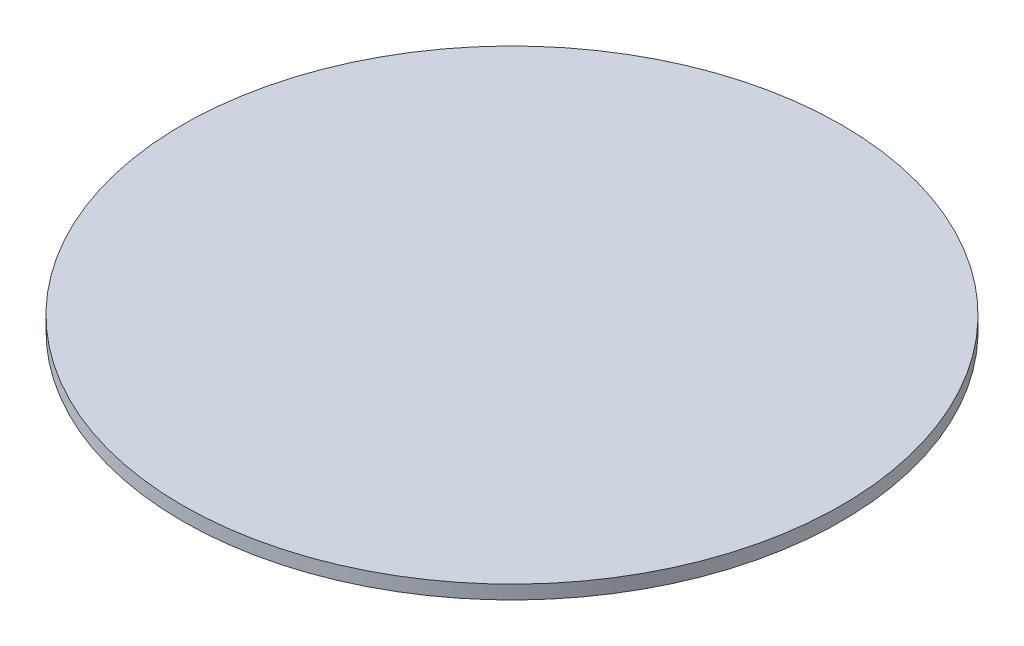
ISO-10303-21;
HEADER;
FILE_DESCRIPTION(('STEP AP214'),'2;1');
FILE_NAME('part.step','',(''),(''),'','','');
FILE_SCHEMA(('AUTOMOTIVE_DESIGN { 1 0 10303 214 1 1 1 1 }'));
ENDSEC;
DATA;
#1=APPLICATION_CONTEXT('core data for automotive mechanical design processes');
#2=APPLICATION_PROTOCOL_DEFINITION('international standard','automotive_design',2000,#1);
#3=PRODUCT_CONTEXT('',#1,'mechanical');
#4=PRODUCT('Part','Part','',(#3));
#5=PRODUCT_RELATED_PRODUCT_CATEGORY('part','',(#4));
#6=PRODUCT_DEFINITION_FORMATION('','',#4);
#7=PRODUCT_DEFINITION_CONTEXT('part definition',#1,'design');
#8=PRODUCT_DEFINITION('design','',#6,#7);
#9=PRODUCT_DEFINITION_SHAPE('','',#8);
#10=(LENGTH_UNIT() NAMED_UNIT(*) SI_UNIT(.MILLI.,.METRE.));
#11=(NAMED_UNIT(*) PLANE_ANGLE_UNIT() SI_UNIT($,.RADIAN.));
#12=(NAMED_UNIT(*) SI_UNIT($,.STERADIAN.) SOLID_ANGLE_UNIT());
#13=UNCERTAINTY_MEASURE_WITH_UNIT(LENGTH_MEASURE(1.E-05),#10,'distance_accuracy_value','');
#14=(GEOMETRIC_REPRESENTATION_CONTEXT(3) GLOBAL_UNCERTAINTY_ASSIGNED_CONTEXT((#13)) GLOBAL_UNIT_ASSIGNED_CONTEXT((#10,
#11,#12)) REPRESENTATION_CONTEXT('',''));
#15=CARTESIAN_POINT('',(0.,0.,0.));
#16=DIRECTION('',(0.,0.,1.));
#17=DIRECTION('',(1.,0.,0.));
#18=AXIS2_PLACEMENT_3D('',#15,#16,#17);
#19=CARTESIAN_POINT('',(0.,3.175,0.));
#20=DIRECTION('',(0.,-1.,0.));
#21=DIRECTION('',(0.,0.,-1.));
#22=AXIS2_PLACEMENT_3D('',#19,#20,#21);
#23=CYLINDRICAL_SURFACE('',#22,76.2);
#24=CARTESIAN_POINT('',(0.,3.175,0.));
#25=DIRECTION('',(0.,1.,0.));
#26=DIRECTION('',(0.,0.,1.));
#27=AXIS2_PLACEMENT_3D('',#24,#25,#26);
#28=CIRCLE('',#27,76.2);
#29=CARTESIAN_POINT('',(0.,3.175,76.2));
#30=VERTEX_POINT('',#29);
#31=EDGE_CURVE('E10',#30,#30,#28,.T.);
#32=ORIENTED_EDGE('',*,*,#31,.F.);
#33=EDGE_LOOP('',(#32));
#34=FACE_BOUND('',#33,.T.);
#35=CARTESIAN_POINT('',(0.,0.,0.));
#36=DIRECTION('',(0.,1.,0.));
#37=DIRECTION('',(0.,0.,1.));
#38=AXIS2_PLACEMENT_3D('',#35,#36,#37);
#39=CIRCLE('',#38,76.2);
#40=CARTESIAN_POINT('',(0.,0.,76.2));
#41=VERTEX_POINT('',#40);
#42=EDGE_CURVE('E34',#41,#41,#39,.T.);
#43=ORIENTED_EDGE('',*,*,#42,.T.);
#44=EDGE_LOOP('',(#43));
#45=FACE_BOUND('',#44,.T.);
#46=ADVANCED_FACE('F31',(#34,#45),#23,.T.);
#47=CARTESIAN_POINT('',(0.,3.175,0.));
#48=DIRECTION('',(0.,1.,0.));
#49=DIRECTION('',(0.,0.,1.));
#50=AXIS2_PLACEMENT_3D('',#47,#48,#49);
#51=PLANE('',#50);
#52=ORIENTED_EDGE('',*,*,#31,.T.);
#53=EDGE_LOOP('',(#52));
#54=FACE_BOUND('',#53,.T.);
#55=ADVANCED_FACE('F46',(#54),#51,.T.);
#56=CARTESIAN_POINT('',(0.,0.,0.));
#57=DIRECTION('',(0.,1.,0.));
#58=DIRECTION('',(0.,0.,1.));
#59=AXIS2_PLACEMENT_3D('',#56,#57,#58);
#60=PLANE('',#59);
#61=ORIENTED_EDGE('',*,*,#42,.F.);
#62=EDGE_LOOP('',(#61));
#63=FACE_BOUND('',#62,.T.);
#64=ADVANCED_FACE('F44',(#63),#60,.F.);
#65=CLOSED_SHELL('',(#46,#55,#64));
#66=MANIFOLD_SOLID_BREP('B2',#65);
#67=ADVANCED_BREP_SHAPE_REPRESENTATION('',(#18,#66),#14);
#68=SHAPE_DEFINITION_REPRESENTATION(#9,#67);
ENDSEC;
END-ISO-10303-21;
